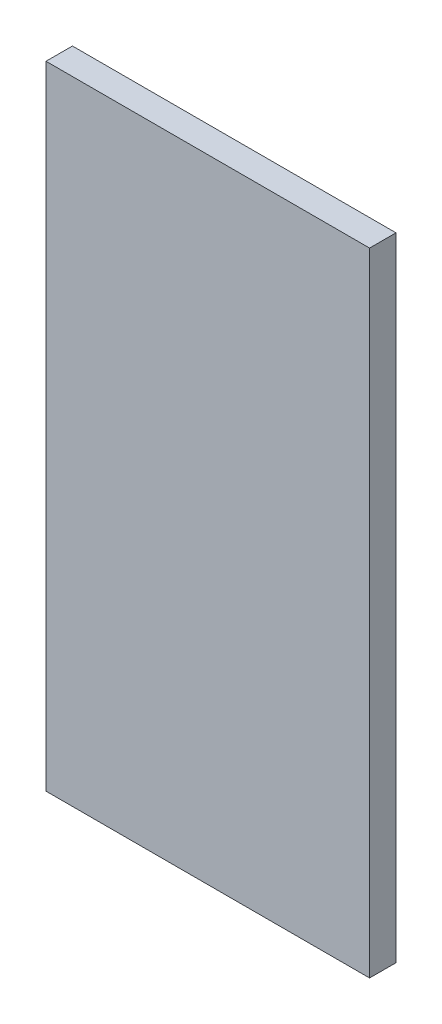
ISO-10303-21;
HEADER;
FILE_DESCRIPTION(('STEP AP214'),'2;1');
FILE_NAME('part.step','',(''),(''),'','','');
FILE_SCHEMA(('AUTOMOTIVE_DESIGN { 1 0 10303 214 1 1 1 1 }'));
ENDSEC;
DATA;
#1=APPLICATION_CONTEXT('core data for automotive mechanical design processes');
#2=APPLICATION_PROTOCOL_DEFINITION('international standard','automotive_design',2000,#1);
#3=PRODUCT_CONTEXT('',#1,'mechanical');
#4=PRODUCT('Part','Part','',(#3));
#5=PRODUCT_RELATED_PRODUCT_CATEGORY('part','',(#4));
#6=PRODUCT_DEFINITION_FORMATION('','',#4);
#7=PRODUCT_DEFINITION_CONTEXT('part definition',#1,'design');
#8=PRODUCT_DEFINITION('design','',#6,#7);
#9=PRODUCT_DEFINITION_SHAPE('','',#8);
#10=(LENGTH_UNIT() NAMED_UNIT(*) SI_UNIT(.MILLI.,.METRE.));
#11=(NAMED_UNIT(*) PLANE_ANGLE_UNIT() SI_UNIT($,.RADIAN.));
#12=(NAMED_UNIT(*) SI_UNIT($,.STERADIAN.) SOLID_ANGLE_UNIT());
#13=UNCERTAINTY_MEASURE_WITH_UNIT(LENGTH_MEASURE(1.E-05),#10,'distance_accuracy_value','');
#14=(GEOMETRIC_REPRESENTATION_CONTEXT(3) GLOBAL_UNCERTAINTY_ASSIGNED_CONTEXT((#13)) GLOBAL_UNIT_ASSIGNED_CONTEXT((#10,
#11,#12)) REPRESENTATION_CONTEXT('',''));
#15=CARTESIAN_POINT('',(0.,0.,0.));
#16=DIRECTION('',(0.,0.,1.));
#17=DIRECTION('',(1.,0.,0.));
#18=AXIS2_PLACEMENT_3D('',#15,#16,#17);
#19=CARTESIAN_POINT('',(3.06173886,-5.9817,0.499999));
#20=DIRECTION('',(0.,0.,1.));
#21=DIRECTION('',(1.,0.,0.));
#22=AXIS2_PLACEMENT_3D('',#19,#20,#21);
#23=PLANE('',#22);
#24=DIRECTION('',(-1.,0.,0.));
#25=VECTOR('',#24,1.);
#26=CARTESIAN_POINT('',(3.06173886,-5.9817,0.499999));
#27=LINE('',#26,#25);
#28=CARTESIAN_POINT('',(3.06173886,-5.9817,0.499999));
#29=VERTEX_POINT('',#28);
#30=CARTESIAN_POINT('',(-3.06173886,-5.9817,0.499999));
#31=VERTEX_POINT('',#30);
#32=EDGE_CURVE('E94',#29,#31,#27,.T.);
#33=ORIENTED_EDGE('',*,*,#32,.F.);
#34=DIRECTION('',(0.,-1.,0.));
#35=VECTOR('',#34,1.);
#36=CARTESIAN_POINT('',(3.06173886,5.9817,0.499999));
#37=LINE('',#36,#35);
#38=CARTESIAN_POINT('',(3.06173886,5.9817,0.499999));
#39=VERTEX_POINT('',#38);
#40=EDGE_CURVE('E27',#39,#29,#37,.T.);
#41=ORIENTED_EDGE('',*,*,#40,.F.);
#42=DIRECTION('',(1.,0.,0.));
#43=VECTOR('',#42,1.);
#44=CARTESIAN_POINT('',(-3.06173886,5.9817,0.499999));
#45=LINE('',#44,#43);
#46=CARTESIAN_POINT('',(-3.06173886,5.9817,0.499999));
#47=VERTEX_POINT('',#46);
#48=EDGE_CURVE('E70',#47,#39,#45,.T.);
#49=ORIENTED_EDGE('',*,*,#48,.F.);
#50=DIRECTION('',(0.,1.,0.));
#51=VECTOR('',#50,1.);
#52=CARTESIAN_POINT('',(-3.06173886,-5.9817,0.499999));
#53=LINE('',#52,#51);
#54=EDGE_CURVE('E92',#31,#47,#53,.T.);
#55=ORIENTED_EDGE('',*,*,#54,.F.);
#56=EDGE_LOOP('',(#33,#41,#49,#55));
#57=FACE_BOUND('',#56,.T.);
#58=ADVANCED_FACE('F17',(#57),#23,.T.);
#59=CARTESIAN_POINT('',(3.06173886,-5.9817,0.));
#60=DIRECTION('',(0.,0.,1.));
#61=DIRECTION('',(1.,0.,0.));
#62=AXIS2_PLACEMENT_3D('',#59,#60,#61);
#63=PLANE('',#62);
#64=DIRECTION('',(-1.,0.,0.));
#65=VECTOR('',#64,1.);
#66=CARTESIAN_POINT('',(3.06173886,-5.9817,0.));
#67=LINE('',#66,#65);
#68=CARTESIAN_POINT('',(3.06173886,-5.9817,0.));
#69=VERTEX_POINT('',#68);
#70=CARTESIAN_POINT('',(-3.06173886,-5.9817,0.));
#71=VERTEX_POINT('',#70);
#72=EDGE_CURVE('E87',#69,#71,#67,.T.);
#73=ORIENTED_EDGE('',*,*,#72,.T.);
#74=DIRECTION('',(0.,1.,0.));
#75=VECTOR('',#74,1.);
#76=CARTESIAN_POINT('',(-3.06173886,-5.9817,0.));
#77=LINE('',#76,#75);
#78=CARTESIAN_POINT('',(-3.06173886,5.9817,0.));
#79=VERTEX_POINT('',#78);
#80=EDGE_CURVE('E79',#71,#79,#77,.T.);
#81=ORIENTED_EDGE('',*,*,#80,.T.);
#82=DIRECTION('',(1.,0.,0.));
#83=VECTOR('',#82,1.);
#84=CARTESIAN_POINT('',(-3.06173886,5.9817,0.));
#85=LINE('',#84,#83);
#86=CARTESIAN_POINT('',(3.06173886,5.9817,0.));
#87=VERTEX_POINT('',#86);
#88=EDGE_CURVE('E114',#79,#87,#85,.T.);
#89=ORIENTED_EDGE('',*,*,#88,.T.);
#90=DIRECTION('',(0.,-1.,0.));
#91=VECTOR('',#90,1.);
#92=CARTESIAN_POINT('',(3.06173886,5.9817,0.));
#93=LINE('',#92,#91);
#94=EDGE_CURVE('E11',#87,#69,#93,.T.);
#95=ORIENTED_EDGE('',*,*,#94,.T.);
#96=EDGE_LOOP('',(#73,#81,#89,#95));
#97=FACE_BOUND('',#96,.T.);
#98=ADVANCED_FACE('F88',(#97),#63,.F.);
#99=CARTESIAN_POINT('',(3.06173886,5.9817,0.));
#100=DIRECTION('',(1.,0.,0.));
#101=DIRECTION('',(0.,1.,0.));
#102=AXIS2_PLACEMENT_3D('',#99,#100,#101);
#103=PLANE('',#102);
#104=DIRECTION('',(0.,0.,1.));
#105=VECTOR('',#104,1.);
#106=CARTESIAN_POINT('',(3.06173886,5.9817,0.));
#107=LINE('',#106,#105);
#108=EDGE_CURVE('E121',#87,#39,#107,.T.);
#109=ORIENTED_EDGE('',*,*,#108,.T.);
#110=ORIENTED_EDGE('',*,*,#40,.T.);
#111=DIRECTION('',(0.,0.,1.));
#112=VECTOR('',#111,1.);
#113=CARTESIAN_POINT('',(3.06173886,-5.9817,0.));
#114=LINE('',#113,#112);
#115=EDGE_CURVE('E101',#69,#29,#114,.T.);
#116=ORIENTED_EDGE('',*,*,#115,.F.);
#117=ORIENTED_EDGE('',*,*,#94,.F.);
#118=EDGE_LOOP('',(#109,#110,#116,#117));
#119=FACE_BOUND('',#118,.T.);
#120=ADVANCED_FACE('F159',(#119),#103,.T.);
#121=CARTESIAN_POINT('',(-3.06173886,5.9817,0.));
#122=DIRECTION('',(0.,1.,0.));
#123=DIRECTION('',(1.,0.,0.));
#124=AXIS2_PLACEMENT_3D('',#121,#122,#123);
#125=PLANE('',#124);
#126=DIRECTION('',(0.,0.,1.));
#127=VECTOR('',#126,1.);
#128=CARTESIAN_POINT('',(-3.06173886,5.9817,0.));
#129=LINE('',#128,#127);
#130=EDGE_CURVE('E84',#79,#47,#129,.T.);
#131=ORIENTED_EDGE('',*,*,#130,.T.);
#132=ORIENTED_EDGE('',*,*,#48,.T.);
#133=ORIENTED_EDGE('',*,*,#108,.F.);
#134=ORIENTED_EDGE('',*,*,#88,.F.);
#135=EDGE_LOOP('',(#131,#132,#133,#134));
#136=FACE_BOUND('',#135,.T.);
#137=ADVANCED_FACE('F112',(#136),#125,.T.);
#138=CARTESIAN_POINT('',(-3.06173886,-5.9817,0.));
#139=DIRECTION('',(-1.,0.,0.));
#140=DIRECTION('',(0.,0.,1.));
#141=AXIS2_PLACEMENT_3D('',#138,#139,#140);
#142=PLANE('',#141);
#143=DIRECTION('',(0.,0.,1.));
#144=VECTOR('',#143,1.);
#145=CARTESIAN_POINT('',(-3.06173886,-5.9817,0.));
#146=LINE('',#145,#144);
#147=EDGE_CURVE('E82',#71,#31,#146,.T.);
#148=ORIENTED_EDGE('',*,*,#147,.T.);
#149=ORIENTED_EDGE('',*,*,#54,.T.);
#150=ORIENTED_EDGE('',*,*,#130,.F.);
#151=ORIENTED_EDGE('',*,*,#80,.F.);
#152=EDGE_LOOP('',(#148,#149,#150,#151));
#153=FACE_BOUND('',#152,.T.);
#154=ADVANCED_FACE('F19',(#153),#142,.T.);
#155=CARTESIAN_POINT('',(3.06173886,-5.9817,0.));
#156=DIRECTION('',(0.,-1.,0.));
#157=DIRECTION('',(0.,0.,-1.));
#158=AXIS2_PLACEMENT_3D('',#155,#156,#157);
#159=PLANE('',#158);
#160=ORIENTED_EDGE('',*,*,#115,.T.);
#161=ORIENTED_EDGE('',*,*,#32,.T.);
#162=ORIENTED_EDGE('',*,*,#147,.F.);
#163=ORIENTED_EDGE('',*,*,#72,.F.);
#164=EDGE_LOOP('',(#160,#161,#162,#163));
#165=FACE_BOUND('',#164,.T.);
#166=ADVANCED_FACE('F93',(#165),#159,.T.);
#167=CLOSED_SHELL('',(#58,#98,#120,#137,#154,#166));
#168=MANIFOLD_SOLID_BREP('B1',#167);
#169=ADVANCED_BREP_SHAPE_REPRESENTATION('',(#18,#168),#14);
#170=SHAPE_DEFINITION_REPRESENTATION(#9,#169);
ENDSEC;
END-ISO-10303-21;
